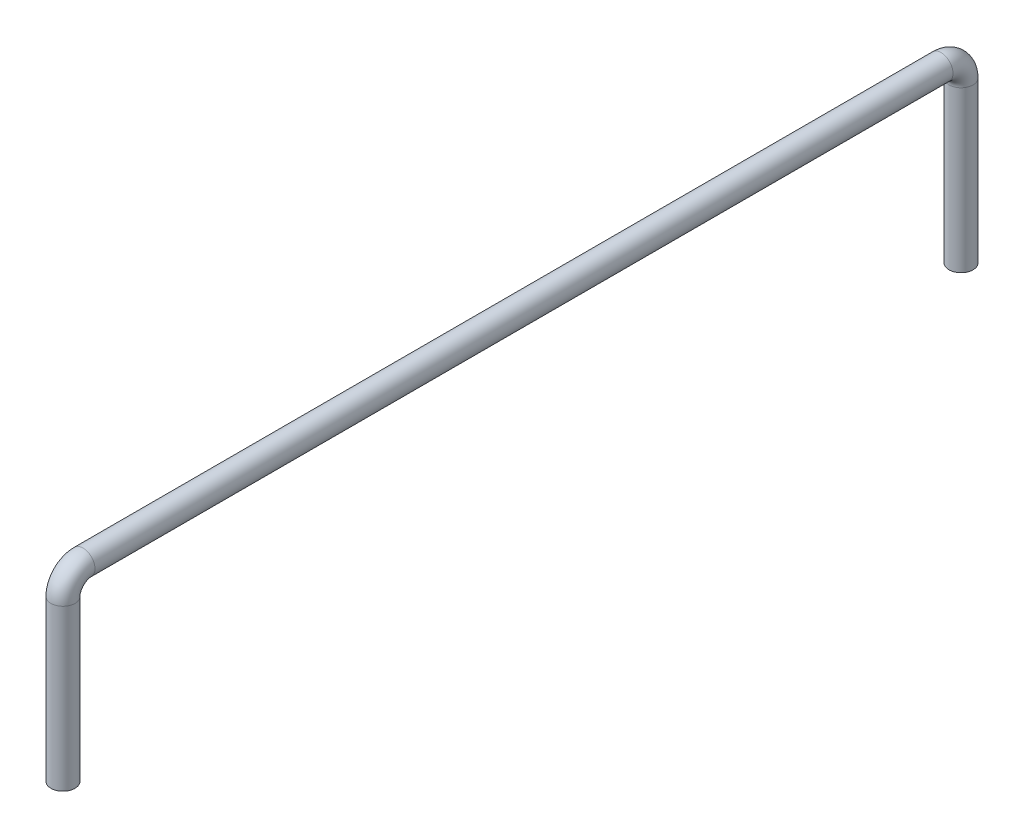
ISO-10303-21;
HEADER;
FILE_DESCRIPTION(('STEP AP214'),'2;1');
FILE_NAME('part.step','',(''),(''),'','','');
FILE_SCHEMA(('AUTOMOTIVE_DESIGN { 1 0 10303 214 1 1 1 1 }'));
ENDSEC;
DATA;
#1=APPLICATION_CONTEXT('core data for automotive mechanical design processes');
#2=APPLICATION_PROTOCOL_DEFINITION('international standard','automotive_design',2000,#1);
#3=PRODUCT_CONTEXT('',#1,'mechanical');
#4=PRODUCT('Part','Part','',(#3));
#5=PRODUCT_RELATED_PRODUCT_CATEGORY('part','',(#4));
#6=PRODUCT_DEFINITION_FORMATION('','',#4);
#7=PRODUCT_DEFINITION_CONTEXT('part definition',#1,'design');
#8=PRODUCT_DEFINITION('design','',#6,#7);
#9=PRODUCT_DEFINITION_SHAPE('','',#8);
#10=(LENGTH_UNIT() NAMED_UNIT(*) SI_UNIT(.MILLI.,.METRE.));
#11=(NAMED_UNIT(*) PLANE_ANGLE_UNIT() SI_UNIT($,.RADIAN.));
#12=(NAMED_UNIT(*) SI_UNIT($,.STERADIAN.) SOLID_ANGLE_UNIT());
#13=UNCERTAINTY_MEASURE_WITH_UNIT(LENGTH_MEASURE(1.E-05),#10,'distance_accuracy_value','');
#14=(GEOMETRIC_REPRESENTATION_CONTEXT(3) GLOBAL_UNCERTAINTY_ASSIGNED_CONTEXT((#13)) GLOBAL_UNIT_ASSIGNED_CONTEXT((#10,
#11,#12)) REPRESENTATION_CONTEXT('',''));
#15=CARTESIAN_POINT('',(0.,0.,0.));
#16=DIRECTION('',(0.,0.,1.));
#17=DIRECTION('',(1.,0.,0.));
#18=AXIS2_PLACEMENT_3D('',#15,#16,#17);
#19=CARTESIAN_POINT('',(0.,0.,0.));
#20=DIRECTION('',(0.,-1.,0.));
#21=DIRECTION('',(0.,0.,-1.));
#22=AXIS2_PLACEMENT_3D('',#19,#20,#21);
#23=PLANE('',#22);
#24=CARTESIAN_POINT('',(0.,0.,0.));
#25=DIRECTION('',(0.,-1.,0.));
#26=DIRECTION('',(0.,0.,-1.));
#27=AXIS2_PLACEMENT_3D('',#24,#25,#26);
#28=CIRCLE('',#27,0.6);
#29=CARTESIAN_POINT('',(0.,0.,-0.6));
#30=VERTEX_POINT('',#29);
#31=EDGE_CURVE('E67',#30,#30,#28,.T.);
#32=ORIENTED_EDGE('',*,*,#31,.T.);
#33=EDGE_LOOP('',(#32));
#34=FACE_BOUND('',#33,.T.);
#35=ADVANCED_FACE('F45',(#34),#23,.T.);
#36=CARTESIAN_POINT('',(0.,0.,44.85922));
#37=DIRECTION('',(0.,1.,0.));
#38=DIRECTION('',(0.,0.,1.));
#39=AXIS2_PLACEMENT_3D('',#36,#37,#38);
#40=PLANE('',#39);
#41=CARTESIAN_POINT('',(0.,0.,44.85922));
#42=DIRECTION('',(0.,1.,0.));
#43=DIRECTION('',(0.,0.,1.));
#44=AXIS2_PLACEMENT_3D('',#41,#42,#43);
#45=CIRCLE('',#44,0.6);
#46=CARTESIAN_POINT('',(0.,0.,45.45922));
#47=VERTEX_POINT('',#46);
#48=EDGE_CURVE('E11',#47,#47,#45,.T.);
#49=ORIENTED_EDGE('',*,*,#48,.F.);
#50=EDGE_LOOP('',(#49));
#51=FACE_BOUND('',#50,.T.);
#52=ADVANCED_FACE('F75',(#51),#40,.F.);
#53=CARTESIAN_POINT('',(0.,0.,0.));
#54=DIRECTION('',(0.,1.,0.));
#55=DIRECTION('',(0.,0.,1.));
#56=AXIS2_PLACEMENT_3D('',#53,#54,#55);
#57=CYLINDRICAL_SURFACE('',#56,0.6);
#58=CARTESIAN_POINT('',(0.,8.,0.));
#59=DIRECTION('',(0.,-1.,0.));
#60=DIRECTION('',(0.,0.,-1.));
#61=AXIS2_PLACEMENT_3D('',#58,#59,#60);
#62=CIRCLE('',#61,0.6);
#63=CARTESIAN_POINT('',(0.,8.,-0.6));
#64=VERTEX_POINT('',#63);
#65=EDGE_CURVE('E64',#64,#64,#62,.T.);
#66=ORIENTED_EDGE('',*,*,#65,.T.);
#67=EDGE_LOOP('',(#66));
#68=FACE_BOUND('',#67,.T.);
#69=ORIENTED_EDGE('',*,*,#31,.F.);
#70=EDGE_LOOP('',(#69));
#71=FACE_BOUND('',#70,.T.);
#72=ADVANCED_FACE('F72',(#68,#71),#57,.T.);
#73=CARTESIAN_POINT('',(0.,8.,1.));
#74=DIRECTION('',(1.,0.,0.));
#75=DIRECTION('',(0.,0.,-1.));
#76=AXIS2_PLACEMENT_3D('',#73,#74,#75);
#77=TOROIDAL_SURFACE('',#76,1.,0.6);
#78=CARTESIAN_POINT('',(0.,9.,1.));
#79=DIRECTION('',(0.,0.,-1.));
#80=DIRECTION('',(0.,1.,0.));
#81=AXIS2_PLACEMENT_3D('',#78,#79,#80);
#82=CIRCLE('',#81,0.6);
#83=CARTESIAN_POINT('',(0.,9.6,1.));
#84=VERTEX_POINT('',#83);
#85=EDGE_CURVE('E59',#84,#84,#82,.T.);
#86=CARTESIAN_POINT('',(0.,8.,1.));
#87=DIRECTION('',(1.,0.,0.));
#88=DIRECTION('',(0.,0.,-1.));
#89=AXIS2_PLACEMENT_3D('',#86,#87,#88);
#90=CIRCLE('',#89,1.6);
#91=EDGE_CURVE('',#64,#84,#90,.T.);
#92=ORIENTED_EDGE('',*,*,#65,.F.);
#93=ORIENTED_EDGE('',*,*,#85,.T.);
#94=ORIENTED_EDGE('',*,*,#91,.T.);
#95=ORIENTED_EDGE('',*,*,#91,.F.);
#96=EDGE_LOOP('',(#92,#94,#93,#95));
#97=FACE_BOUND('',#96,.T.);
#98=ADVANCED_FACE('F74',(#97),#77,.T.);
#99=CARTESIAN_POINT('',(0.,9.,1.));
#100=DIRECTION('',(0.,0.,1.));
#101=DIRECTION('',(0.,-1.,0.));
#102=AXIS2_PLACEMENT_3D('',#99,#100,#101);
#103=CYLINDRICAL_SURFACE('',#102,0.6);
#104=CARTESIAN_POINT('',(0.,9.,43.85922));
#105=DIRECTION('',(0.,0.,-1.));
#106=DIRECTION('',(0.,1.,0.));
#107=AXIS2_PLACEMENT_3D('',#104,#105,#106);
#108=CIRCLE('',#107,0.6);
#109=CARTESIAN_POINT('',(0.,9.6,43.85922));
#110=VERTEX_POINT('',#109);
#111=EDGE_CURVE('E55',#110,#110,#108,.T.);
#112=ORIENTED_EDGE('',*,*,#111,.T.);
#113=EDGE_LOOP('',(#112));
#114=FACE_BOUND('',#113,.T.);
#115=ORIENTED_EDGE('',*,*,#85,.F.);
#116=EDGE_LOOP('',(#115));
#117=FACE_BOUND('',#116,.T.);
#118=ADVANCED_FACE('F82',(#114,#117),#103,.T.);
#119=CARTESIAN_POINT('',(0.,8.,43.85922));
#120=DIRECTION('',(1.,0.,0.));
#121=DIRECTION('',(0.,0.,-1.));
#122=AXIS2_PLACEMENT_3D('',#119,#120,#121);
#123=TOROIDAL_SURFACE('',#122,1.,0.6);
#124=CARTESIAN_POINT('',(0.,8.,44.85922));
#125=DIRECTION('',(0.,1.,0.));
#126=DIRECTION('',(0.,0.,1.));
#127=AXIS2_PLACEMENT_3D('',#124,#125,#126);
#128=CIRCLE('',#127,0.6);
#129=CARTESIAN_POINT('',(0.,8.,45.45922));
#130=VERTEX_POINT('',#129);
#131=EDGE_CURVE('E51',#130,#130,#128,.T.);
#132=CARTESIAN_POINT('',(0.,8.,43.85922));
#133=DIRECTION('',(1.,0.,0.));
#134=DIRECTION('',(0.,0.,-1.));
#135=AXIS2_PLACEMENT_3D('',#132,#133,#134);
#136=CIRCLE('',#135,1.6);
#137=EDGE_CURVE('',#110,#130,#136,.T.);
#138=ORIENTED_EDGE('',*,*,#111,.F.);
#139=ORIENTED_EDGE('',*,*,#131,.T.);
#140=ORIENTED_EDGE('',*,*,#137,.T.);
#141=ORIENTED_EDGE('',*,*,#137,.F.);
#142=EDGE_LOOP('',(#138,#140,#139,#141));
#143=FACE_BOUND('',#142,.T.);
#144=ADVANCED_FACE('F88',(#143),#123,.T.);
#145=CARTESIAN_POINT('',(0.,8.,44.85922));
#146=DIRECTION('',(0.,-1.,0.));
#147=DIRECTION('',(0.,0.,-1.));
#148=AXIS2_PLACEMENT_3D('',#145,#146,#147);
#149=CYLINDRICAL_SURFACE('',#148,0.6);
#150=ORIENTED_EDGE('',*,*,#48,.T.);
#151=EDGE_LOOP('',(#150));
#152=FACE_BOUND('',#151,.T.);
#153=ORIENTED_EDGE('',*,*,#131,.F.);
#154=EDGE_LOOP('',(#153));
#155=FACE_BOUND('',#154,.T.);
#156=ADVANCED_FACE('F86',(#152,#155),#149,.T.);
#157=CLOSED_SHELL('',(#35,#52,#72,#98,#118,#144,#156));
#158=MANIFOLD_SOLID_BREP('B2',#157);
#159=ADVANCED_BREP_SHAPE_REPRESENTATION('',(#18,#158),#14);
#160=SHAPE_DEFINITION_REPRESENTATION(#9,#159);
ENDSEC;
END-ISO-10303-21;
